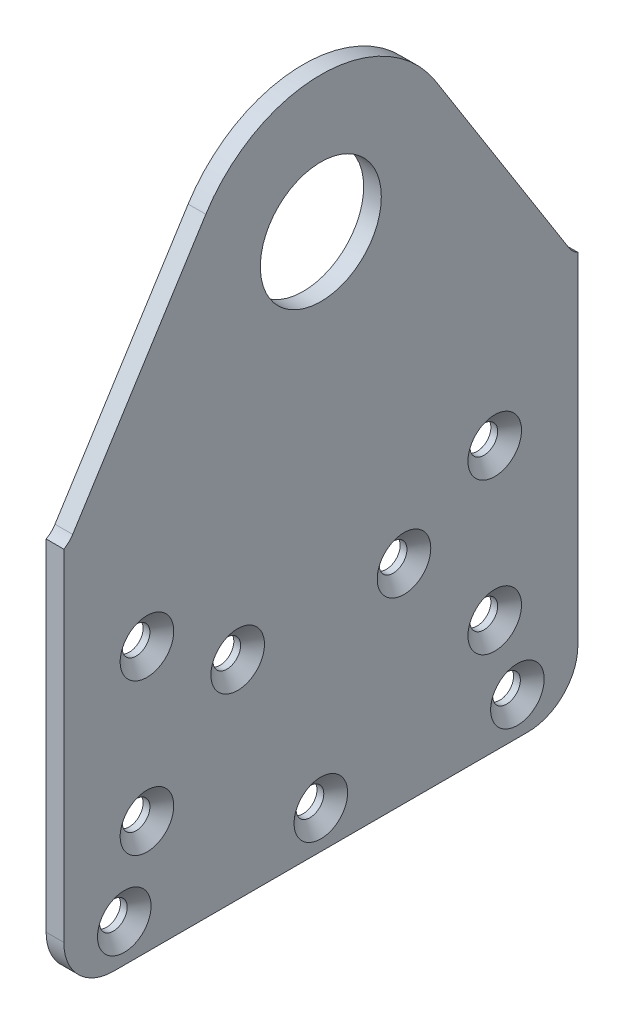
ISO-10303-21;
HEADER;
FILE_DESCRIPTION(('STEP AP214'),'2;1');
FILE_NAME('part.step','',(''),(''),'','','');
FILE_SCHEMA(('AUTOMOTIVE_DESIGN { 1 0 10303 214 1 1 1 1 }'));
ENDSEC;
DATA;
#1=APPLICATION_CONTEXT('core data for automotive mechanical design processes');
#2=APPLICATION_PROTOCOL_DEFINITION('international standard','automotive_design',2000,#1);
#3=PRODUCT_CONTEXT('',#1,'mechanical');
#4=PRODUCT('Part','Part','',(#3));
#5=PRODUCT_RELATED_PRODUCT_CATEGORY('part','',(#4));
#6=PRODUCT_DEFINITION_FORMATION('','',#4);
#7=PRODUCT_DEFINITION_CONTEXT('part definition',#1,'design');
#8=PRODUCT_DEFINITION('design','',#6,#7);
#9=PRODUCT_DEFINITION_SHAPE('','',#8);
#10=(LENGTH_UNIT() NAMED_UNIT(*) SI_UNIT(.MILLI.,.METRE.));
#11=(NAMED_UNIT(*) PLANE_ANGLE_UNIT() SI_UNIT($,.RADIAN.));
#12=(NAMED_UNIT(*) SI_UNIT($,.STERADIAN.) SOLID_ANGLE_UNIT());
#13=UNCERTAINTY_MEASURE_WITH_UNIT(LENGTH_MEASURE(1.E-05),#10,'distance_accuracy_value','');
#14=(GEOMETRIC_REPRESENTATION_CONTEXT(3) GLOBAL_UNCERTAINTY_ASSIGNED_CONTEXT((#13)) GLOBAL_UNIT_ASSIGNED_CONTEXT((#10,
#11,#12)) REPRESENTATION_CONTEXT('',''));
#15=CARTESIAN_POINT('',(0.,0.,0.));
#16=DIRECTION('',(0.,0.,1.));
#17=DIRECTION('',(1.,0.,0.));
#18=AXIS2_PLACEMENT_3D('',#15,#16,#17);
#19=CARTESIAN_POINT('',(2.3368,0.,0.));
#20=DIRECTION('',(-1.,0.,0.));
#21=DIRECTION('',(0.,0.,1.));
#22=AXIS2_PLACEMENT_3D('',#19,#20,#21);
#23=PLANE('',#22);
#24=CARTESIAN_POINT('',(2.3368,-66.,26.));
#25=DIRECTION('',(1.,0.,0.));
#26=DIRECTION('',(0.,0.,-1.));
#27=AXIS2_PLACEMENT_3D('',#24,#25,#26);
#28=CIRCLE('',#27,3.5433);
#29=CARTESIAN_POINT('',(2.3368,-66.,22.4567));
#30=VERTEX_POINT('',#29);
#31=EDGE_CURVE('E297',#30,#30,#28,.T.);
#32=ORIENTED_EDGE('',*,*,#31,.F.);
#33=EDGE_LOOP('',(#32));
#34=FACE_BOUND('',#33,.T.);
#35=CARTESIAN_POINT('',(2.3368,-56.,23.));
#36=DIRECTION('',(1.,0.,0.));
#37=DIRECTION('',(0.,0.,-1.));
#38=AXIS2_PLACEMENT_3D('',#35,#36,#37);
#39=CIRCLE('',#38,3.5433);
#40=CARTESIAN_POINT('',(2.3368,-56.,19.4567));
#41=VERTEX_POINT('',#40);
#42=EDGE_CURVE('E288',#41,#41,#39,.T.);
#43=ORIENTED_EDGE('',*,*,#42,.F.);
#44=EDGE_LOOP('',(#43));
#45=FACE_BOUND('',#44,.T.);
#46=CARTESIAN_POINT('',(2.3368,-36.,23.));
#47=DIRECTION('',(1.,0.,0.));
#48=DIRECTION('',(0.,0.,-1.));
#49=AXIS2_PLACEMENT_3D('',#46,#47,#48);
#50=CIRCLE('',#49,3.5433);
#51=CARTESIAN_POINT('',(2.3368,-36.,19.4567));
#52=VERTEX_POINT('',#51);
#53=EDGE_CURVE('E279',#52,#52,#50,.T.);
#54=ORIENTED_EDGE('',*,*,#53,.F.);
#55=EDGE_LOOP('',(#54));
#56=FACE_BOUND('',#55,.T.);
#57=CARTESIAN_POINT('',(2.3368,-43.5,11.));
#58=DIRECTION('',(1.,0.,0.));
#59=DIRECTION('',(0.,0.,-1.));
#60=AXIS2_PLACEMENT_3D('',#57,#58,#59);
#61=CIRCLE('',#60,3.5433);
#62=CARTESIAN_POINT('',(2.3368,-43.5,7.4567));
#63=VERTEX_POINT('',#62);
#64=EDGE_CURVE('E270',#63,#63,#61,.T.);
#65=ORIENTED_EDGE('',*,*,#64,.F.);
#66=EDGE_LOOP('',(#65));
#67=FACE_BOUND('',#66,.T.);
#68=CARTESIAN_POINT('',(2.3368,-66.,0.));
#69=DIRECTION('',(1.,0.,0.));
#70=DIRECTION('',(0.,0.,-1.));
#71=AXIS2_PLACEMENT_3D('',#68,#69,#70);
#72=CIRCLE('',#71,3.5433);
#73=CARTESIAN_POINT('',(2.3368,-66.,-3.54330000000004));
#74=VERTEX_POINT('',#73);
#75=EDGE_CURVE('E261',#74,#74,#72,.T.);
#76=ORIENTED_EDGE('',*,*,#75,.F.);
#77=EDGE_LOOP('',(#76));
#78=FACE_BOUND('',#77,.T.);
#79=CARTESIAN_POINT('',(2.3368,-66.,-26.));
#80=DIRECTION('',(1.,0.,0.));
#81=DIRECTION('',(0.,0.,-1.));
#82=AXIS2_PLACEMENT_3D('',#79,#80,#81);
#83=CIRCLE('',#82,3.5433);
#84=CARTESIAN_POINT('',(2.3368,-66.,-29.5433));
#85=VERTEX_POINT('',#84);
#86=EDGE_CURVE('E252',#85,#85,#83,.T.);
#87=ORIENTED_EDGE('',*,*,#86,.F.);
#88=EDGE_LOOP('',(#87));
#89=FACE_BOUND('',#88,.T.);
#90=CARTESIAN_POINT('',(2.3368,-56.,-23.));
#91=DIRECTION('',(1.,0.,0.));
#92=DIRECTION('',(0.,0.,-1.));
#93=AXIS2_PLACEMENT_3D('',#90,#91,#92);
#94=CIRCLE('',#93,3.5433);
#95=CARTESIAN_POINT('',(2.3368,-56.,-26.5433));
#96=VERTEX_POINT('',#95);
#97=EDGE_CURVE('E243',#96,#96,#94,.T.);
#98=ORIENTED_EDGE('',*,*,#97,.F.);
#99=EDGE_LOOP('',(#98));
#100=FACE_BOUND('',#99,.T.);
#101=CARTESIAN_POINT('',(2.3368,-43.5,-11.));
#102=DIRECTION('',(1.,0.,0.));
#103=DIRECTION('',(0.,0.,-1.));
#104=AXIS2_PLACEMENT_3D('',#101,#102,#103);
#105=CIRCLE('',#104,3.5433);
#106=CARTESIAN_POINT('',(2.3368,-43.5,-14.5433));
#107=VERTEX_POINT('',#106);
#108=EDGE_CURVE('E234',#107,#107,#105,.T.);
#109=ORIENTED_EDGE('',*,*,#108,.F.);
#110=EDGE_LOOP('',(#109));
#111=FACE_BOUND('',#110,.T.);
#112=CARTESIAN_POINT('',(2.3368,-36.,-23.));
#113=DIRECTION('',(1.,0.,0.));
#114=DIRECTION('',(0.,0.,-1.));
#115=AXIS2_PLACEMENT_3D('',#112,#113,#114);
#116=CIRCLE('',#115,3.5433);
#117=CARTESIAN_POINT('',(2.3368,-36.,-26.5433));
#118=VERTEX_POINT('',#117);
#119=EDGE_CURVE('E225',#118,#118,#116,.T.);
#120=ORIENTED_EDGE('',*,*,#119,.F.);
#121=EDGE_LOOP('',(#120));
#122=FACE_BOUND('',#121,.T.);
#123=DIRECTION('',(0.,0.,-1.));
#124=VECTOR('',#123,1.);
#125=CARTESIAN_POINT('',(2.3368,-71.,34.));
#126=LINE('',#125,#124);
#127=CARTESIAN_POINT('',(2.3368,-71.,27.4));
#128=VERTEX_POINT('',#127);
#129=CARTESIAN_POINT('',(2.3368,-71.,-27.4));
#130=VERTEX_POINT('',#129);
#131=EDGE_CURVE('E158',#128,#130,#126,.T.);
#132=ORIENTED_EDGE('',*,*,#131,.T.);
#133=CARTESIAN_POINT('',(2.3368,-64.4,-27.4));
#134=DIRECTION('',(-1.,0.,0.));
#135=DIRECTION('',(0.,0.,1.));
#136=AXIS2_PLACEMENT_3D('',#133,#134,#135);
#137=CIRCLE('',#136,6.6);
#138=CARTESIAN_POINT('',(2.3368,-64.4,-34.));
#139=VERTEX_POINT('',#138);
#140=EDGE_CURVE('E41',#130,#139,#137,.F.);
#141=ORIENTED_EDGE('',*,*,#140,.T.);
#142=DIRECTION('',(0.,1.,0.));
#143=VECTOR('',#142,1.);
#144=CARTESIAN_POINT('',(2.3368,-19.3515907672462,-34.));
#145=LINE('',#144,#143);
#146=CARTESIAN_POINT('',(2.3368,-19.3515907672462,-34.));
#147=VERTEX_POINT('',#146);
#148=EDGE_CURVE('E156',#139,#147,#145,.T.);
#149=ORIENTED_EDGE('',*,*,#148,.T.);
#150=CARTESIAN_POINT('',(2.3368,-16.5581834950006,-35.509139096096));
#151=DIRECTION('',(-1.,0.,0.));
#152=DIRECTION('',(0.,0.,-1.));
#153=AXIS2_PLACEMENT_3D('',#150,#151,#152);
#154=CIRCLE('',#153,3.175);
#155=CARTESIAN_POINT('',(2.3368,-18.2540696375616,-32.8250013962994));
#156=VERTEX_POINT('',#155);
#157=EDGE_CURVE('E167',#147,#156,#154,.T.);
#158=ORIENTED_EDGE('',*,*,#157,.T.);
#159=DIRECTION('',(0.,0.845397700723349,0.534137367735749));
#160=VECTOR('',#159,1.);
#161=CARTESIAN_POINT('',(2.3368,9.61447261924348,-15.2171586130203));
#162=LINE('',#161,#160);
#163=CARTESIAN_POINT('',(2.3368,9.61447261924348,-15.2171586130203));
#164=VERTEX_POINT('',#163);
#165=EDGE_CURVE('E128',#156,#164,#162,.T.);
#166=ORIENTED_EDGE('',*,*,#165,.T.);
#167=CARTESIAN_POINT('',(2.3368,0.,0.));
#168=DIRECTION('',(1.,0.,0.));
#169=DIRECTION('',(0.,0.,1.));
#170=AXIS2_PLACEMENT_3D('',#167,#168,#169);
#171=CIRCLE('',#170,18.);
#172=CARTESIAN_POINT('',(2.3368,9.61447261924348,15.2171586130203));
#173=VERTEX_POINT('',#172);
#174=EDGE_CURVE('E123',#164,#173,#171,.T.);
#175=ORIENTED_EDGE('',*,*,#174,.T.);
#176=DIRECTION('',(0.,-0.845397700723349,0.534137367735749));
#177=VECTOR('',#176,1.);
#178=CARTESIAN_POINT('',(2.3368,9.61447261924348,15.2171586130203));
#179=LINE('',#178,#177);
#180=CARTESIAN_POINT('',(2.3368,-18.2540696375616,32.8250013962994));
#181=VERTEX_POINT('',#180);
#182=EDGE_CURVE('E112',#173,#181,#179,.T.);
#183=ORIENTED_EDGE('',*,*,#182,.T.);
#184=CARTESIAN_POINT('',(2.3368,-16.5581834950006,35.509139096096));
#185=DIRECTION('',(-1.,0.,0.));
#186=DIRECTION('',(0.,0.,-1.));
#187=AXIS2_PLACEMENT_3D('',#184,#185,#186);
#188=CIRCLE('',#187,3.175);
#189=CARTESIAN_POINT('',(2.3368,-19.3515907672461,34.));
#190=VERTEX_POINT('',#189);
#191=EDGE_CURVE('E122',#181,#190,#188,.T.);
#192=ORIENTED_EDGE('',*,*,#191,.T.);
#193=DIRECTION('',(0.,-1.,0.));
#194=VECTOR('',#193,1.);
#195=CARTESIAN_POINT('',(2.3368,-19.3515907672461,34.));
#196=LINE('',#195,#194);
#197=CARTESIAN_POINT('',(2.3368,-64.4,34.));
#198=VERTEX_POINT('',#197);
#199=EDGE_CURVE('E198',#190,#198,#196,.T.);
#200=ORIENTED_EDGE('',*,*,#199,.T.);
#201=CARTESIAN_POINT('',(2.3368,-64.4,27.4));
#202=DIRECTION('',(-1.,0.,0.));
#203=DIRECTION('',(0.,0.,1.));
#204=AXIS2_PLACEMENT_3D('',#201,#202,#203);
#205=CIRCLE('',#204,6.6);
#206=EDGE_CURVE('E153',#198,#128,#205,.F.);
#207=ORIENTED_EDGE('',*,*,#206,.T.);
#208=EDGE_LOOP('',(#132,#141,#149,#158,#166,#175,#183,#192,#200,#207));
#209=FACE_BOUND('',#208,.T.);
#210=CARTESIAN_POINT('',(2.3368,0.,0.));
#211=DIRECTION('',(1.,0.,0.));
#212=DIRECTION('',(0.,0.,-1.));
#213=AXIS2_PLACEMENT_3D('',#210,#211,#212);
#214=CIRCLE('',#213,8.);
#215=CARTESIAN_POINT('',(2.3368,0.,-8.));
#216=VERTEX_POINT('',#215);
#217=EDGE_CURVE('E211',#216,#216,#214,.T.);
#218=ORIENTED_EDGE('',*,*,#217,.F.);
#219=EDGE_LOOP('',(#218));
#220=FACE_BOUND('',#219,.T.);
#221=ADVANCED_FACE('F33',(#34,#45,#56,#67,#78,#89,#100,#111,#122,#209,#220),#23,.F.);
#222=CARTESIAN_POINT('',(0.,0.,0.));
#223=DIRECTION('',(-1.,0.,0.));
#224=DIRECTION('',(0.,0.,1.));
#225=AXIS2_PLACEMENT_3D('',#222,#223,#224);
#226=PLANE('',#225);
#227=CARTESIAN_POINT('',(0.,-66.,26.));
#228=DIRECTION('',(1.,0.,0.));
#229=DIRECTION('',(0.,0.,-1.));
#230=AXIS2_PLACEMENT_3D('',#227,#228,#229);
#231=CIRCLE('',#230,1.82880000000001);
#232=CARTESIAN_POINT('',(0.,-66.,24.1712));
#233=VERTEX_POINT('',#232);
#234=EDGE_CURVE('E291',#233,#233,#231,.T.);
#235=ORIENTED_EDGE('',*,*,#234,.T.);
#236=EDGE_LOOP('',(#235));
#237=FACE_BOUND('',#236,.T.);
#238=CARTESIAN_POINT('',(0.,-56.,23.));
#239=DIRECTION('',(1.,0.,0.));
#240=DIRECTION('',(0.,0.,-1.));
#241=AXIS2_PLACEMENT_3D('',#238,#239,#240);
#242=CIRCLE('',#241,1.8288);
#243=CARTESIAN_POINT('',(0.,-56.,21.1712));
#244=VERTEX_POINT('',#243);
#245=EDGE_CURVE('E282',#244,#244,#242,.T.);
#246=ORIENTED_EDGE('',*,*,#245,.T.);
#247=EDGE_LOOP('',(#246));
#248=FACE_BOUND('',#247,.T.);
#249=CARTESIAN_POINT('',(0.,-36.,23.));
#250=DIRECTION('',(1.,0.,0.));
#251=DIRECTION('',(0.,0.,-1.));
#252=AXIS2_PLACEMENT_3D('',#249,#250,#251);
#253=CIRCLE('',#252,1.8288);
#254=CARTESIAN_POINT('',(0.,-36.,21.1712));
#255=VERTEX_POINT('',#254);
#256=EDGE_CURVE('E273',#255,#255,#253,.T.);
#257=ORIENTED_EDGE('',*,*,#256,.T.);
#258=EDGE_LOOP('',(#257));
#259=FACE_BOUND('',#258,.T.);
#260=CARTESIAN_POINT('',(0.,-43.5,11.));
#261=DIRECTION('',(1.,0.,0.));
#262=DIRECTION('',(0.,0.,-1.));
#263=AXIS2_PLACEMENT_3D('',#260,#261,#262);
#264=CIRCLE('',#263,1.8288);
#265=CARTESIAN_POINT('',(0.,-43.5,9.1712));
#266=VERTEX_POINT('',#265);
#267=EDGE_CURVE('E264',#266,#266,#264,.T.);
#268=ORIENTED_EDGE('',*,*,#267,.T.);
#269=EDGE_LOOP('',(#268));
#270=FACE_BOUND('',#269,.T.);
#271=CARTESIAN_POINT('',(0.,-66.,0.));
#272=DIRECTION('',(1.,0.,0.));
#273=DIRECTION('',(0.,0.,-1.));
#274=AXIS2_PLACEMENT_3D('',#271,#272,#273);
#275=CIRCLE('',#274,1.82880000000001);
#276=CARTESIAN_POINT('',(0.,-66.,-1.82880000000005));
#277=VERTEX_POINT('',#276);
#278=EDGE_CURVE('E255',#277,#277,#275,.T.);
#279=ORIENTED_EDGE('',*,*,#278,.T.);
#280=EDGE_LOOP('',(#279));
#281=FACE_BOUND('',#280,.T.);
#282=CARTESIAN_POINT('',(0.,-66.,-26.));
#283=DIRECTION('',(1.,0.,0.));
#284=DIRECTION('',(0.,0.,-1.));
#285=AXIS2_PLACEMENT_3D('',#282,#283,#284);
#286=CIRCLE('',#285,1.82880000000001);
#287=CARTESIAN_POINT('',(0.,-66.,-27.8288));
#288=VERTEX_POINT('',#287);
#289=EDGE_CURVE('E246',#288,#288,#286,.T.);
#290=ORIENTED_EDGE('',*,*,#289,.T.);
#291=EDGE_LOOP('',(#290));
#292=FACE_BOUND('',#291,.T.);
#293=CARTESIAN_POINT('',(0.,-56.,-23.));
#294=DIRECTION('',(1.,0.,0.));
#295=DIRECTION('',(0.,0.,-1.));
#296=AXIS2_PLACEMENT_3D('',#293,#294,#295);
#297=CIRCLE('',#296,1.8288);
#298=CARTESIAN_POINT('',(0.,-56.,-24.8288));
#299=VERTEX_POINT('',#298);
#300=EDGE_CURVE('E237',#299,#299,#297,.T.);
#301=ORIENTED_EDGE('',*,*,#300,.T.);
#302=EDGE_LOOP('',(#301));
#303=FACE_BOUND('',#302,.T.);
#304=CARTESIAN_POINT('',(0.,-43.5,-11.));
#305=DIRECTION('',(1.,0.,0.));
#306=DIRECTION('',(0.,0.,-1.));
#307=AXIS2_PLACEMENT_3D('',#304,#305,#306);
#308=CIRCLE('',#307,1.8288);
#309=CARTESIAN_POINT('',(0.,-43.5,-12.8288));
#310=VERTEX_POINT('',#309);
#311=EDGE_CURVE('E228',#310,#310,#308,.T.);
#312=ORIENTED_EDGE('',*,*,#311,.T.);
#313=EDGE_LOOP('',(#312));
#314=FACE_BOUND('',#313,.T.);
#315=CARTESIAN_POINT('',(0.,-36.,-23.));
#316=DIRECTION('',(1.,0.,0.));
#317=DIRECTION('',(0.,0.,-1.));
#318=AXIS2_PLACEMENT_3D('',#315,#316,#317);
#319=CIRCLE('',#318,1.8288);
#320=CARTESIAN_POINT('',(0.,-36.,-24.8288));
#321=VERTEX_POINT('',#320);
#322=EDGE_CURVE('E217',#321,#321,#319,.T.);
#323=ORIENTED_EDGE('',*,*,#322,.T.);
#324=EDGE_LOOP('',(#323));
#325=FACE_BOUND('',#324,.T.);
#326=DIRECTION('',(0.,1.,0.));
#327=VECTOR('',#326,1.);
#328=CARTESIAN_POINT('',(0.,-19.3515907672462,-34.));
#329=LINE('',#328,#327);
#330=CARTESIAN_POINT('',(0.,-64.4,-34.));
#331=VERTEX_POINT('',#330);
#332=CARTESIAN_POINT('',(0.,-19.3515907672462,-34.));
#333=VERTEX_POINT('',#332);
#334=EDGE_CURVE('E176',#331,#333,#329,.T.);
#335=ORIENTED_EDGE('',*,*,#334,.F.);
#336=CARTESIAN_POINT('',(0.,-64.4,-27.4));
#337=DIRECTION('',(-1.,0.,0.));
#338=DIRECTION('',(0.,0.,1.));
#339=AXIS2_PLACEMENT_3D('',#336,#337,#338);
#340=CIRCLE('',#339,6.6);
#341=CARTESIAN_POINT('',(0.,-71.,-27.4));
#342=VERTEX_POINT('',#341);
#343=EDGE_CURVE('E147',#331,#342,#340,.T.);
#344=ORIENTED_EDGE('',*,*,#343,.T.);
#345=DIRECTION('',(0.,0.,-1.));
#346=VECTOR('',#345,1.);
#347=CARTESIAN_POINT('',(0.,-71.,34.));
#348=LINE('',#347,#346);
#349=CARTESIAN_POINT('',(0.,-71.,27.4));
#350=VERTEX_POINT('',#349);
#351=EDGE_CURVE('E174',#350,#342,#348,.T.);
#352=ORIENTED_EDGE('',*,*,#351,.F.);
#353=CARTESIAN_POINT('',(0.,-64.4,27.4));
#354=DIRECTION('',(-1.,0.,0.));
#355=DIRECTION('',(0.,0.,1.));
#356=AXIS2_PLACEMENT_3D('',#353,#354,#355);
#357=CIRCLE('',#356,6.6);
#358=CARTESIAN_POINT('',(0.,-64.4,34.));
#359=VERTEX_POINT('',#358);
#360=EDGE_CURVE('E140',#350,#359,#357,.T.);
#361=ORIENTED_EDGE('',*,*,#360,.T.);
#362=DIRECTION('',(0.,-1.,0.));
#363=VECTOR('',#362,1.);
#364=CARTESIAN_POINT('',(0.,-19.3515907672461,34.));
#365=LINE('',#364,#363);
#366=CARTESIAN_POINT('',(0.,-19.3515907672461,34.));
#367=VERTEX_POINT('',#366);
#368=EDGE_CURVE('E179',#367,#359,#365,.T.);
#369=ORIENTED_EDGE('',*,*,#368,.F.);
#370=CARTESIAN_POINT('',(0.,-16.5581834950006,35.509139096096));
#371=DIRECTION('',(-1.,0.,0.));
#372=DIRECTION('',(0.,0.,-1.));
#373=AXIS2_PLACEMENT_3D('',#370,#371,#372);
#374=CIRCLE('',#373,3.175);
#375=CARTESIAN_POINT('',(0.,-18.2540696375616,32.8250013962994));
#376=VERTEX_POINT('',#375);
#377=EDGE_CURVE('E183',#376,#367,#374,.T.);
#378=ORIENTED_EDGE('',*,*,#377,.F.);
#379=DIRECTION('',(0.,-0.845397700723349,0.534137367735749));
#380=VECTOR('',#379,1.);
#381=CARTESIAN_POINT('',(0.,9.61447261924348,15.2171586130203));
#382=LINE('',#381,#380);
#383=CARTESIAN_POINT('',(0.,9.61447261924348,15.2171586130203));
#384=VERTEX_POINT('',#383);
#385=EDGE_CURVE('E210',#384,#376,#382,.T.);
#386=ORIENTED_EDGE('',*,*,#385,.F.);
#387=CARTESIAN_POINT('',(0.,0.,0.));
#388=DIRECTION('',(1.,0.,0.));
#389=DIRECTION('',(0.,0.,1.));
#390=AXIS2_PLACEMENT_3D('',#387,#388,#389);
#391=CIRCLE('',#390,18.);
#392=CARTESIAN_POINT('',(0.,9.61447261924348,-15.2171586130203));
#393=VERTEX_POINT('',#392);
#394=EDGE_CURVE('E136',#393,#384,#391,.T.);
#395=ORIENTED_EDGE('',*,*,#394,.F.);
#396=DIRECTION('',(0.,0.845397700723349,0.534137367735749));
#397=VECTOR('',#396,1.);
#398=CARTESIAN_POINT('',(0.,9.61447261924348,-15.2171586130203));
#399=LINE('',#398,#397);
#400=CARTESIAN_POINT('',(0.,-18.2540696375616,-32.8250013962994));
#401=VERTEX_POINT('',#400);
#402=EDGE_CURVE('E132',#401,#393,#399,.T.);
#403=ORIENTED_EDGE('',*,*,#402,.F.);
#404=CARTESIAN_POINT('',(0.,-16.5581834950006,-35.509139096096));
#405=DIRECTION('',(-1.,0.,0.));
#406=DIRECTION('',(0.,0.,-1.));
#407=AXIS2_PLACEMENT_3D('',#404,#405,#406);
#408=CIRCLE('',#407,3.175);
#409=EDGE_CURVE('E181',#333,#401,#408,.T.);
#410=ORIENTED_EDGE('',*,*,#409,.F.);
#411=EDGE_LOOP('',(#335,#344,#352,#361,#369,#378,#386,#395,#403,#410));
#412=FACE_BOUND('',#411,.T.);
#413=CARTESIAN_POINT('',(0.,0.,0.));
#414=DIRECTION('',(1.,0.,0.));
#415=DIRECTION('',(0.,0.,-1.));
#416=AXIS2_PLACEMENT_3D('',#413,#414,#415);
#417=CIRCLE('',#416,8.);
#418=CARTESIAN_POINT('',(0.,0.,-8.));
#419=VERTEX_POINT('',#418);
#420=EDGE_CURVE('E214',#419,#419,#417,.T.);
#421=ORIENTED_EDGE('',*,*,#420,.T.);
#422=EDGE_LOOP('',(#421));
#423=FACE_BOUND('',#422,.T.);
#424=ADVANCED_FACE('F172',(#237,#248,#259,#270,#281,#292,#303,#314,#325,#412,#423),#226,.T.);
#425=CARTESIAN_POINT('',(2.3368,0.,0.));
#426=DIRECTION('',(-1.,0.,0.));
#427=DIRECTION('',(0.,0.,1.));
#428=AXIS2_PLACEMENT_3D('',#425,#426,#427);
#429=CYLINDRICAL_SURFACE('',#428,18.);
#430=ORIENTED_EDGE('',*,*,#394,.T.);
#431=DIRECTION('',(-1.,0.,0.));
#432=VECTOR('',#431,1.);
#433=CARTESIAN_POINT('',(2.3368,9.61447261924348,15.2171586130203));
#434=LINE('',#433,#432);
#435=EDGE_CURVE('E116',#173,#384,#434,.T.);
#436=ORIENTED_EDGE('',*,*,#435,.F.);
#437=ORIENTED_EDGE('',*,*,#174,.F.);
#438=DIRECTION('',(-1.,0.,0.));
#439=VECTOR('',#438,1.);
#440=CARTESIAN_POINT('',(2.3368,9.61447261924348,-15.2171586130203));
#441=LINE('',#440,#439);
#442=EDGE_CURVE('E189',#164,#393,#441,.T.);
#443=ORIENTED_EDGE('',*,*,#442,.T.);
#444=EDGE_LOOP('',(#430,#436,#437,#443));
#445=FACE_BOUND('',#444,.T.);
#446=ADVANCED_FACE('F134',(#445),#429,.T.);
#447=CARTESIAN_POINT('',(2.3368,9.61447261924348,15.2171586130203));
#448=DIRECTION('',(0.,-0.534137367735749,-0.845397700723349));
#449=DIRECTION('',(0.,0.845397700723349,-0.534137367735749));
#450=AXIS2_PLACEMENT_3D('',#447,#448,#449);
#451=PLANE('',#450);
#452=ORIENTED_EDGE('',*,*,#385,.T.);
#453=DIRECTION('',(-1.,0.,0.));
#454=VECTOR('',#453,1.);
#455=CARTESIAN_POINT('',(2.3368,-18.2540696375616,32.8250013962994));
#456=LINE('',#455,#454);
#457=EDGE_CURVE('E119',#181,#376,#456,.T.);
#458=ORIENTED_EDGE('',*,*,#457,.F.);
#459=ORIENTED_EDGE('',*,*,#182,.F.);
#460=ORIENTED_EDGE('',*,*,#435,.T.);
#461=EDGE_LOOP('',(#452,#458,#459,#460));
#462=FACE_BOUND('',#461,.T.);
#463=ADVANCED_FACE('F114',(#462),#451,.F.);
#464=CARTESIAN_POINT('',(2.3368,-16.5581834950006,35.509139096096));
#465=DIRECTION('',(-1.,0.,0.));
#466=DIRECTION('',(0.,0.,1.));
#467=AXIS2_PLACEMENT_3D('',#464,#465,#466);
#468=CYLINDRICAL_SURFACE('',#467,3.175);
#469=ORIENTED_EDGE('',*,*,#377,.T.);
#470=DIRECTION('',(-1.,0.,0.));
#471=VECTOR('',#470,1.);
#472=CARTESIAN_POINT('',(2.3368,-19.3515907672461,34.));
#473=LINE('',#472,#471);
#474=EDGE_CURVE('E142',#190,#367,#473,.T.);
#475=ORIENTED_EDGE('',*,*,#474,.F.);
#476=ORIENTED_EDGE('',*,*,#191,.F.);
#477=ORIENTED_EDGE('',*,*,#457,.T.);
#478=EDGE_LOOP('',(#469,#475,#476,#477));
#479=FACE_BOUND('',#478,.T.);
#480=ADVANCED_FACE('F212',(#479),#468,.F.);
#481=CARTESIAN_POINT('',(2.3368,-19.3515907672461,34.));
#482=DIRECTION('',(0.,0.,-1.));
#483=DIRECTION('',(0.,1.,0.));
#484=AXIS2_PLACEMENT_3D('',#481,#482,#483);
#485=PLANE('',#484);
#486=ORIENTED_EDGE('',*,*,#368,.T.);
#487=DIRECTION('',(-1.,0.,0.));
#488=VECTOR('',#487,1.);
#489=CARTESIAN_POINT('',(2.3368,-64.4,34.));
#490=LINE('',#489,#488);
#491=EDGE_CURVE('E11',#359,#198,#490,.F.);
#492=ORIENTED_EDGE('',*,*,#491,.T.);
#493=ORIENTED_EDGE('',*,*,#199,.F.);
#494=ORIENTED_EDGE('',*,*,#474,.T.);
#495=EDGE_LOOP('',(#486,#492,#493,#494));
#496=FACE_BOUND('',#495,.T.);
#497=ADVANCED_FACE('F197',(#496),#485,.F.);
#498=CARTESIAN_POINT('',(2.3368,-71.,34.));
#499=DIRECTION('',(0.,1.,0.));
#500=DIRECTION('',(0.,0.,1.));
#501=AXIS2_PLACEMENT_3D('',#498,#499,#500);
#502=PLANE('',#501);
#503=ORIENTED_EDGE('',*,*,#351,.T.);
#504=DIRECTION('',(-1.,0.,0.));
#505=VECTOR('',#504,1.);
#506=CARTESIAN_POINT('',(2.3368,-71.,-27.4));
#507=LINE('',#506,#505);
#508=EDGE_CURVE('E54',#342,#130,#507,.F.);
#509=ORIENTED_EDGE('',*,*,#508,.T.);
#510=ORIENTED_EDGE('',*,*,#131,.F.);
#511=DIRECTION('',(-1.,0.,0.));
#512=VECTOR('',#511,1.);
#513=CARTESIAN_POINT('',(2.3368,-71.,27.4));
#514=LINE('',#513,#512);
#515=EDGE_CURVE('E149',#128,#350,#514,.T.);
#516=ORIENTED_EDGE('',*,*,#515,.T.);
#517=EDGE_LOOP('',(#503,#509,#510,#516));
#518=FACE_BOUND('',#517,.T.);
#519=ADVANCED_FACE('F177',(#518),#502,.F.);
#520=CARTESIAN_POINT('',(2.3368,-19.3515907672462,-34.));
#521=DIRECTION('',(0.,0.,1.));
#522=DIRECTION('',(0.,-1.,0.));
#523=AXIS2_PLACEMENT_3D('',#520,#521,#522);
#524=PLANE('',#523);
#525=ORIENTED_EDGE('',*,*,#148,.F.);
#526=DIRECTION('',(-1.,0.,0.));
#527=VECTOR('',#526,1.);
#528=CARTESIAN_POINT('',(2.3368,-64.4,-34.));
#529=LINE('',#528,#527);
#530=EDGE_CURVE('E137',#139,#331,#529,.T.);
#531=ORIENTED_EDGE('',*,*,#530,.T.);
#532=ORIENTED_EDGE('',*,*,#334,.T.);
#533=DIRECTION('',(-1.,0.,0.));
#534=VECTOR('',#533,1.);
#535=CARTESIAN_POINT('',(2.3368,-19.3515907672462,-34.));
#536=LINE('',#535,#534);
#537=EDGE_CURVE('E165',#147,#333,#536,.T.);
#538=ORIENTED_EDGE('',*,*,#537,.F.);
#539=EDGE_LOOP('',(#525,#531,#532,#538));
#540=FACE_BOUND('',#539,.T.);
#541=ADVANCED_FACE('F162',(#540),#524,.F.);
#542=CARTESIAN_POINT('',(2.3368,-16.5581834950006,-35.509139096096));
#543=DIRECTION('',(-1.,0.,0.));
#544=DIRECTION('',(0.,0.,1.));
#545=AXIS2_PLACEMENT_3D('',#542,#543,#544);
#546=CYLINDRICAL_SURFACE('',#545,3.175);
#547=ORIENTED_EDGE('',*,*,#409,.T.);
#548=DIRECTION('',(-1.,0.,0.));
#549=VECTOR('',#548,1.);
#550=CARTESIAN_POINT('',(2.3368,-18.2540696375616,-32.8250013962994));
#551=LINE('',#550,#549);
#552=EDGE_CURVE('E191',#156,#401,#551,.T.);
#553=ORIENTED_EDGE('',*,*,#552,.F.);
#554=ORIENTED_EDGE('',*,*,#157,.F.);
#555=ORIENTED_EDGE('',*,*,#537,.T.);
#556=EDGE_LOOP('',(#547,#553,#554,#555));
#557=FACE_BOUND('',#556,.T.);
#558=ADVANCED_FACE('F350',(#557),#546,.F.);
#559=CARTESIAN_POINT('',(2.3368,9.61447261924348,-15.2171586130203));
#560=DIRECTION('',(0.,-0.534137367735749,0.845397700723349));
#561=DIRECTION('',(0.,-0.845397700723349,-0.534137367735749));
#562=AXIS2_PLACEMENT_3D('',#559,#560,#561);
#563=PLANE('',#562);
#564=ORIENTED_EDGE('',*,*,#402,.T.);
#565=ORIENTED_EDGE('',*,*,#442,.F.);
#566=ORIENTED_EDGE('',*,*,#165,.F.);
#567=ORIENTED_EDGE('',*,*,#552,.T.);
#568=EDGE_LOOP('',(#564,#565,#566,#567));
#569=FACE_BOUND('',#568,.T.);
#570=ADVANCED_FACE('F342',(#569),#563,.F.);
#571=CARTESIAN_POINT('',(2.3368,0.,0.));
#572=DIRECTION('',(-1.,0.,0.));
#573=DIRECTION('',(0.,0.,1.));
#574=AXIS2_PLACEMENT_3D('',#571,#572,#573);
#575=CYLINDRICAL_SURFACE('',#574,8.);
#576=ORIENTED_EDGE('',*,*,#217,.T.);
#577=EDGE_LOOP('',(#576));
#578=FACE_BOUND('',#577,.T.);
#579=ORIENTED_EDGE('',*,*,#420,.F.);
#580=EDGE_LOOP('',(#579));
#581=FACE_BOUND('',#580,.T.);
#582=ADVANCED_FACE('F335',(#578,#581),#575,.F.);
#583=CARTESIAN_POINT('',(2.3368,-36.,-23.));
#584=DIRECTION('',(1.,0.,0.));
#585=DIRECTION('',(0.,0.,-1.));
#586=AXIS2_PLACEMENT_3D('',#583,#584,#585);
#587=CYLINDRICAL_SURFACE('',#586,1.8288);
#588=ORIENTED_EDGE('',*,*,#322,.F.);
#589=EDGE_LOOP('',(#588));
#590=FACE_BOUND('',#589,.T.);
#591=CARTESIAN_POINT('',(0.898163682346552,-36.,-23.));
#592=DIRECTION('',(1.,0.,0.));
#593=DIRECTION('',(0.,0.,-1.));
#594=AXIS2_PLACEMENT_3D('',#591,#592,#593);
#595=CIRCLE('',#594,1.8288);
#596=CARTESIAN_POINT('',(0.898163682346552,-36.,-24.8288));
#597=VERTEX_POINT('',#596);
#598=EDGE_CURVE('E222',#597,#597,#595,.T.);
#599=ORIENTED_EDGE('',*,*,#598,.T.);
#600=EDGE_LOOP('',(#599));
#601=FACE_BOUND('',#600,.T.);
#602=ADVANCED_FACE('F325',(#590,#601),#587,.F.);
#603=CARTESIAN_POINT('',(2.3368,-36.,-23.));
#604=DIRECTION('',(1.,0.,0.));
#605=DIRECTION('',(0.,0.,-1.));
#606=AXIS2_PLACEMENT_3D('',#603,#604,#605);
#607=CONICAL_SURFACE('',#606,3.5433,0.872664625997164);
#608=ORIENTED_EDGE('',*,*,#598,.F.);
#609=EDGE_LOOP('',(#608));
#610=FACE_BOUND('',#609,.T.);
#611=ORIENTED_EDGE('',*,*,#119,.T.);
#612=EDGE_LOOP('',(#611));
#613=FACE_BOUND('',#612,.T.);
#614=ADVANCED_FACE('F322',(#610,#613),#607,.F.);
#615=CARTESIAN_POINT('',(2.3368,-43.5,-11.));
#616=DIRECTION('',(1.,0.,0.));
#617=DIRECTION('',(0.,0.,-1.));
#618=AXIS2_PLACEMENT_3D('',#615,#616,#617);
#619=CYLINDRICAL_SURFACE('',#618,1.8288);
#620=ORIENTED_EDGE('',*,*,#311,.F.);
#621=EDGE_LOOP('',(#620));
#622=FACE_BOUND('',#621,.T.);
#623=CARTESIAN_POINT('',(0.898163682346552,-43.5,-11.));
#624=DIRECTION('',(1.,0.,0.));
#625=DIRECTION('',(0.,0.,-1.));
#626=AXIS2_PLACEMENT_3D('',#623,#624,#625);
#627=CIRCLE('',#626,1.8288);
#628=CARTESIAN_POINT('',(0.898163682346552,-43.5,-12.8288));
#629=VERTEX_POINT('',#628);
#630=EDGE_CURVE('E231',#629,#629,#627,.T.);
#631=ORIENTED_EDGE('',*,*,#630,.T.);
#632=EDGE_LOOP('',(#631));
#633=FACE_BOUND('',#632,.T.);
#634=ADVANCED_FACE('F324',(#622,#633),#619,.F.);
#635=CARTESIAN_POINT('',(2.3368,-43.5,-11.));
#636=DIRECTION('',(1.,0.,0.));
#637=DIRECTION('',(0.,0.,-1.));
#638=AXIS2_PLACEMENT_3D('',#635,#636,#637);
#639=CONICAL_SURFACE('',#638,3.5433,0.872664625997164);
#640=ORIENTED_EDGE('',*,*,#630,.F.);
#641=EDGE_LOOP('',(#640));
#642=FACE_BOUND('',#641,.T.);
#643=ORIENTED_EDGE('',*,*,#108,.T.);
#644=EDGE_LOOP('',(#643));
#645=FACE_BOUND('',#644,.T.);
#646=ADVANCED_FACE('F332',(#642,#645),#639,.F.);
#647=CARTESIAN_POINT('',(2.3368,-56.,-23.));
#648=DIRECTION('',(1.,0.,0.));
#649=DIRECTION('',(0.,0.,-1.));
#650=AXIS2_PLACEMENT_3D('',#647,#648,#649);
#651=CYLINDRICAL_SURFACE('',#650,1.8288);
#652=ORIENTED_EDGE('',*,*,#300,.F.);
#653=EDGE_LOOP('',(#652));
#654=FACE_BOUND('',#653,.T.);
#655=CARTESIAN_POINT('',(0.898163682346552,-56.,-23.));
#656=DIRECTION('',(1.,0.,0.));
#657=DIRECTION('',(0.,0.,-1.));
#658=AXIS2_PLACEMENT_3D('',#655,#656,#657);
#659=CIRCLE('',#658,1.8288);
#660=CARTESIAN_POINT('',(0.898163682346552,-56.,-24.8288));
#661=VERTEX_POINT('',#660);
#662=EDGE_CURVE('E240',#661,#661,#659,.T.);
#663=ORIENTED_EDGE('',*,*,#662,.T.);
#664=EDGE_LOOP('',(#663));
#665=FACE_BOUND('',#664,.T.);
#666=ADVANCED_FACE('F424',(#654,#665),#651,.F.);
#667=CARTESIAN_POINT('',(2.3368,-56.,-23.));
#668=DIRECTION('',(1.,0.,0.));
#669=DIRECTION('',(0.,0.,-1.));
#670=AXIS2_PLACEMENT_3D('',#667,#668,#669);
#671=CONICAL_SURFACE('',#670,3.5433,0.872664625997164);
#672=ORIENTED_EDGE('',*,*,#662,.F.);
#673=EDGE_LOOP('',(#672));
#674=FACE_BOUND('',#673,.T.);
#675=ORIENTED_EDGE('',*,*,#97,.T.);
#676=EDGE_LOOP('',(#675));
#677=FACE_BOUND('',#676,.T.);
#678=ADVANCED_FACE('F420',(#674,#677),#671,.F.);
#679=CARTESIAN_POINT('',(2.3368,-66.,-26.));
#680=DIRECTION('',(1.,0.,0.));
#681=DIRECTION('',(0.,0.,-1.));
#682=AXIS2_PLACEMENT_3D('',#679,#680,#681);
#683=CYLINDRICAL_SURFACE('',#682,1.82880000000001);
#684=ORIENTED_EDGE('',*,*,#289,.F.);
#685=EDGE_LOOP('',(#684));
#686=FACE_BOUND('',#685,.T.);
#687=CARTESIAN_POINT('',(0.898163682346552,-66.,-26.));
#688=DIRECTION('',(1.,0.,0.));
#689=DIRECTION('',(0.,0.,-1.));
#690=AXIS2_PLACEMENT_3D('',#687,#688,#689);
#691=CIRCLE('',#690,1.82880000000001);
#692=CARTESIAN_POINT('',(0.898163682346552,-66.,-27.8288));
#693=VERTEX_POINT('',#692);
#694=EDGE_CURVE('E249',#693,#693,#691,.T.);
#695=ORIENTED_EDGE('',*,*,#694,.T.);
#696=EDGE_LOOP('',(#695));
#697=FACE_BOUND('',#696,.T.);
#698=ADVANCED_FACE('F416',(#686,#697),#683,.F.);
#699=CARTESIAN_POINT('',(2.3368,-66.,-26.));
#700=DIRECTION('',(1.,0.,0.));
#701=DIRECTION('',(0.,0.,-1.));
#702=AXIS2_PLACEMENT_3D('',#699,#700,#701);
#703=CONICAL_SURFACE('',#702,3.5433,0.872664625997162);
#704=ORIENTED_EDGE('',*,*,#694,.F.);
#705=EDGE_LOOP('',(#704));
#706=FACE_BOUND('',#705,.T.);
#707=ORIENTED_EDGE('',*,*,#86,.T.);
#708=EDGE_LOOP('',(#707));
#709=FACE_BOUND('',#708,.T.);
#710=ADVANCED_FACE('F412',(#706,#709),#703,.F.);
#711=CARTESIAN_POINT('',(2.3368,-66.,0.));
#712=DIRECTION('',(1.,0.,0.));
#713=DIRECTION('',(0.,0.,-1.));
#714=AXIS2_PLACEMENT_3D('',#711,#712,#713);
#715=CYLINDRICAL_SURFACE('',#714,1.82880000000001);
#716=ORIENTED_EDGE('',*,*,#278,.F.);
#717=EDGE_LOOP('',(#716));
#718=FACE_BOUND('',#717,.T.);
#719=CARTESIAN_POINT('',(0.898163682346552,-66.,0.));
#720=DIRECTION('',(1.,0.,0.));
#721=DIRECTION('',(0.,0.,-1.));
#722=AXIS2_PLACEMENT_3D('',#719,#720,#721);
#723=CIRCLE('',#722,1.82880000000001);
#724=CARTESIAN_POINT('',(0.898163682346552,-66.,-1.82880000000005));
#725=VERTEX_POINT('',#724);
#726=EDGE_CURVE('E258',#725,#725,#723,.T.);
#727=ORIENTED_EDGE('',*,*,#726,.T.);
#728=EDGE_LOOP('',(#727));
#729=FACE_BOUND('',#728,.T.);
#730=ADVANCED_FACE('F408',(#718,#729),#715,.F.);
#731=CARTESIAN_POINT('',(2.3368,-66.,0.));
#732=DIRECTION('',(1.,0.,0.));
#733=DIRECTION('',(0.,0.,-1.));
#734=AXIS2_PLACEMENT_3D('',#731,#732,#733);
#735=CONICAL_SURFACE('',#734,3.5433,0.872664625997162);
#736=ORIENTED_EDGE('',*,*,#726,.F.);
#737=EDGE_LOOP('',(#736));
#738=FACE_BOUND('',#737,.T.);
#739=ORIENTED_EDGE('',*,*,#75,.T.);
#740=EDGE_LOOP('',(#739));
#741=FACE_BOUND('',#740,.T.);
#742=ADVANCED_FACE('F404',(#738,#741),#735,.F.);
#743=CARTESIAN_POINT('',(2.3368,-43.5,11.));
#744=DIRECTION('',(1.,0.,0.));
#745=DIRECTION('',(0.,0.,-1.));
#746=AXIS2_PLACEMENT_3D('',#743,#744,#745);
#747=CYLINDRICAL_SURFACE('',#746,1.8288);
#748=ORIENTED_EDGE('',*,*,#267,.F.);
#749=EDGE_LOOP('',(#748));
#750=FACE_BOUND('',#749,.T.);
#751=CARTESIAN_POINT('',(0.898163682346552,-43.5,11.));
#752=DIRECTION('',(1.,0.,0.));
#753=DIRECTION('',(0.,0.,-1.));
#754=AXIS2_PLACEMENT_3D('',#751,#752,#753);
#755=CIRCLE('',#754,1.8288);
#756=CARTESIAN_POINT('',(0.898163682346552,-43.5,9.1712));
#757=VERTEX_POINT('',#756);
#758=EDGE_CURVE('E267',#757,#757,#755,.T.);
#759=ORIENTED_EDGE('',*,*,#758,.T.);
#760=EDGE_LOOP('',(#759));
#761=FACE_BOUND('',#760,.T.);
#762=ADVANCED_FACE('F400',(#750,#761),#747,.F.);
#763=CARTESIAN_POINT('',(2.3368,-43.5,11.));
#764=DIRECTION('',(1.,0.,0.));
#765=DIRECTION('',(0.,0.,-1.));
#766=AXIS2_PLACEMENT_3D('',#763,#764,#765);
#767=CONICAL_SURFACE('',#766,3.5433,0.872664625997164);
#768=ORIENTED_EDGE('',*,*,#758,.F.);
#769=EDGE_LOOP('',(#768));
#770=FACE_BOUND('',#769,.T.);
#771=ORIENTED_EDGE('',*,*,#64,.T.);
#772=EDGE_LOOP('',(#771));
#773=FACE_BOUND('',#772,.T.);
#774=ADVANCED_FACE('F396',(#770,#773),#767,.F.);
#775=CARTESIAN_POINT('',(2.3368,-36.,23.));
#776=DIRECTION('',(1.,0.,0.));
#777=DIRECTION('',(0.,0.,-1.));
#778=AXIS2_PLACEMENT_3D('',#775,#776,#777);
#779=CYLINDRICAL_SURFACE('',#778,1.8288);
#780=ORIENTED_EDGE('',*,*,#256,.F.);
#781=EDGE_LOOP('',(#780));
#782=FACE_BOUND('',#781,.T.);
#783=CARTESIAN_POINT('',(0.898163682346552,-36.,23.));
#784=DIRECTION('',(1.,0.,0.));
#785=DIRECTION('',(0.,0.,-1.));
#786=AXIS2_PLACEMENT_3D('',#783,#784,#785);
#787=CIRCLE('',#786,1.8288);
#788=CARTESIAN_POINT('',(0.898163682346552,-36.,21.1712));
#789=VERTEX_POINT('',#788);
#790=EDGE_CURVE('E276',#789,#789,#787,.T.);
#791=ORIENTED_EDGE('',*,*,#790,.T.);
#792=EDGE_LOOP('',(#791));
#793=FACE_BOUND('',#792,.T.);
#794=ADVANCED_FACE('F392',(#782,#793),#779,.F.);
#795=CARTESIAN_POINT('',(2.3368,-36.,23.));
#796=DIRECTION('',(1.,0.,0.));
#797=DIRECTION('',(0.,0.,-1.));
#798=AXIS2_PLACEMENT_3D('',#795,#796,#797);
#799=CONICAL_SURFACE('',#798,3.5433,0.872664625997164);
#800=ORIENTED_EDGE('',*,*,#790,.F.);
#801=EDGE_LOOP('',(#800));
#802=FACE_BOUND('',#801,.T.);
#803=ORIENTED_EDGE('',*,*,#53,.T.);
#804=EDGE_LOOP('',(#803));
#805=FACE_BOUND('',#804,.T.);
#806=ADVANCED_FACE('F388',(#802,#805),#799,.F.);
#807=CARTESIAN_POINT('',(2.3368,-56.,23.));
#808=DIRECTION('',(1.,0.,0.));
#809=DIRECTION('',(0.,0.,-1.));
#810=AXIS2_PLACEMENT_3D('',#807,#808,#809);
#811=CYLINDRICAL_SURFACE('',#810,1.8288);
#812=ORIENTED_EDGE('',*,*,#245,.F.);
#813=EDGE_LOOP('',(#812));
#814=FACE_BOUND('',#813,.T.);
#815=CARTESIAN_POINT('',(0.898163682346552,-56.,23.));
#816=DIRECTION('',(1.,0.,0.));
#817=DIRECTION('',(0.,0.,-1.));
#818=AXIS2_PLACEMENT_3D('',#815,#816,#817);
#819=CIRCLE('',#818,1.8288);
#820=CARTESIAN_POINT('',(0.898163682346552,-56.,21.1712));
#821=VERTEX_POINT('',#820);
#822=EDGE_CURVE('E285',#821,#821,#819,.T.);
#823=ORIENTED_EDGE('',*,*,#822,.T.);
#824=EDGE_LOOP('',(#823));
#825=FACE_BOUND('',#824,.T.);
#826=ADVANCED_FACE('F384',(#814,#825),#811,.F.);
#827=CARTESIAN_POINT('',(2.3368,-56.,23.));
#828=DIRECTION('',(1.,0.,0.));
#829=DIRECTION('',(0.,0.,-1.));
#830=AXIS2_PLACEMENT_3D('',#827,#828,#829);
#831=CONICAL_SURFACE('',#830,3.5433,0.872664625997164);
#832=ORIENTED_EDGE('',*,*,#822,.F.);
#833=EDGE_LOOP('',(#832));
#834=FACE_BOUND('',#833,.T.);
#835=ORIENTED_EDGE('',*,*,#42,.T.);
#836=EDGE_LOOP('',(#835));
#837=FACE_BOUND('',#836,.T.);
#838=ADVANCED_FACE('F377',(#834,#837),#831,.F.);
#839=CARTESIAN_POINT('',(2.3368,-66.,26.));
#840=DIRECTION('',(1.,0.,0.));
#841=DIRECTION('',(0.,0.,-1.));
#842=AXIS2_PLACEMENT_3D('',#839,#840,#841);
#843=CYLINDRICAL_SURFACE('',#842,1.82880000000001);
#844=ORIENTED_EDGE('',*,*,#234,.F.);
#845=EDGE_LOOP('',(#844));
#846=FACE_BOUND('',#845,.T.);
#847=CARTESIAN_POINT('',(0.898163682346552,-66.,26.));
#848=DIRECTION('',(1.,0.,0.));
#849=DIRECTION('',(0.,0.,-1.));
#850=AXIS2_PLACEMENT_3D('',#847,#848,#849);
#851=CIRCLE('',#850,1.82880000000001);
#852=CARTESIAN_POINT('',(0.898163682346552,-66.,24.1712));
#853=VERTEX_POINT('',#852);
#854=EDGE_CURVE('E294',#853,#853,#851,.T.);
#855=ORIENTED_EDGE('',*,*,#854,.T.);
#856=EDGE_LOOP('',(#855));
#857=FACE_BOUND('',#856,.T.);
#858=ADVANCED_FACE('F371',(#846,#857),#843,.F.);
#859=CARTESIAN_POINT('',(2.3368,-66.,26.));
#860=DIRECTION('',(1.,0.,0.));
#861=DIRECTION('',(0.,0.,-1.));
#862=AXIS2_PLACEMENT_3D('',#859,#860,#861);
#863=CONICAL_SURFACE('',#862,3.5433,0.872664625997162);
#864=ORIENTED_EDGE('',*,*,#854,.F.);
#865=EDGE_LOOP('',(#864));
#866=FACE_BOUND('',#865,.T.);
#867=ORIENTED_EDGE('',*,*,#31,.T.);
#868=EDGE_LOOP('',(#867));
#869=FACE_BOUND('',#868,.T.);
#870=ADVANCED_FACE('F301',(#866,#869),#863,.F.);
#871=CARTESIAN_POINT('',(2.3368,-64.4,-27.4));
#872=DIRECTION('',(-1.,0.,0.));
#873=DIRECTION('',(0.,0.,1.));
#874=AXIS2_PLACEMENT_3D('',#871,#872,#873);
#875=CYLINDRICAL_SURFACE('',#874,6.6);
#876=ORIENTED_EDGE('',*,*,#140,.F.);
#877=ORIENTED_EDGE('',*,*,#508,.F.);
#878=ORIENTED_EDGE('',*,*,#343,.F.);
#879=ORIENTED_EDGE('',*,*,#530,.F.);
#880=EDGE_LOOP('',(#876,#877,#878,#879));
#881=FACE_BOUND('',#880,.T.);
#882=ADVANCED_FACE('F169',(#881),#875,.T.);
#883=CARTESIAN_POINT('',(2.3368,-64.4,27.4));
#884=DIRECTION('',(-1.,0.,0.));
#885=DIRECTION('',(0.,0.,1.));
#886=AXIS2_PLACEMENT_3D('',#883,#884,#885);
#887=CYLINDRICAL_SURFACE('',#886,6.6);
#888=ORIENTED_EDGE('',*,*,#206,.F.);
#889=ORIENTED_EDGE('',*,*,#491,.F.);
#890=ORIENTED_EDGE('',*,*,#360,.F.);
#891=ORIENTED_EDGE('',*,*,#515,.F.);
#892=EDGE_LOOP('',(#888,#889,#890,#891));
#893=FACE_BOUND('',#892,.T.);
#894=ADVANCED_FACE('F35',(#893),#887,.T.);
#895=CLOSED_SHELL('',(#221,#424,#446,#463,#480,#497,#519,#541,#558,#570,#582,#602,#614,#634,
#646,#666,#678,#698,#710,#730,#742,#762,#774,#794,#806,#826,#838,#858,#870,#882,#894));
#896=MANIFOLD_SOLID_BREP('B2',#895);
#897=ADVANCED_BREP_SHAPE_REPRESENTATION('',(#18,#896),#14);
#898=SHAPE_DEFINITION_REPRESENTATION(#9,#897);
ENDSEC;
END-ISO-10303-21;
